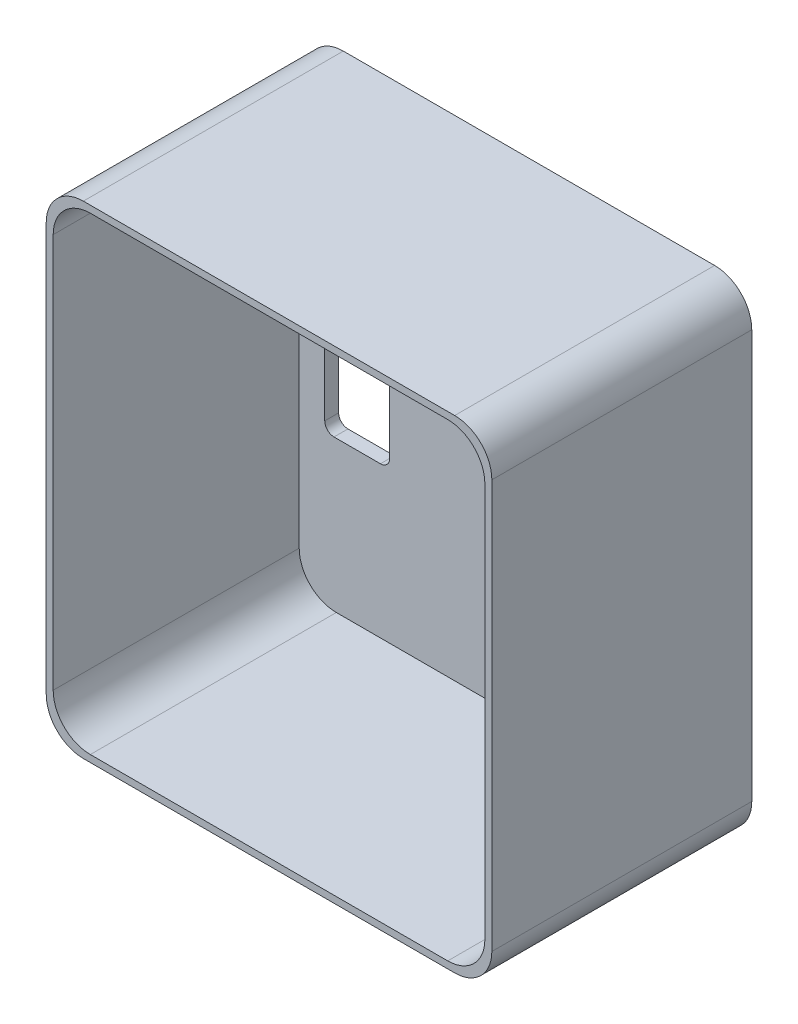
ISO-10303-21;
HEADER;
FILE_DESCRIPTION(('STEP AP214'),'2;1');
FILE_NAME('part.step','',(''),(''),'','','');
FILE_SCHEMA(('AUTOMOTIVE_DESIGN { 1 0 10303 214 1 1 1 1 }'));
ENDSEC;
DATA;
#1=APPLICATION_CONTEXT('core data for automotive mechanical design processes');
#2=APPLICATION_PROTOCOL_DEFINITION('international standard','automotive_design',2000,#1);
#3=PRODUCT_CONTEXT('',#1,'mechanical');
#4=PRODUCT('Part','Part','',(#3));
#5=PRODUCT_RELATED_PRODUCT_CATEGORY('part','',(#4));
#6=PRODUCT_DEFINITION_FORMATION('','',#4);
#7=PRODUCT_DEFINITION_CONTEXT('part definition',#1,'design');
#8=PRODUCT_DEFINITION('design','',#6,#7);
#9=PRODUCT_DEFINITION_SHAPE('','',#8);
#10=(LENGTH_UNIT() NAMED_UNIT(*) SI_UNIT(.MILLI.,.METRE.));
#11=(NAMED_UNIT(*) PLANE_ANGLE_UNIT() SI_UNIT($,.RADIAN.));
#12=(NAMED_UNIT(*) SI_UNIT($,.STERADIAN.) SOLID_ANGLE_UNIT());
#13=UNCERTAINTY_MEASURE_WITH_UNIT(LENGTH_MEASURE(1.E-05),#10,'distance_accuracy_value','');
#14=(GEOMETRIC_REPRESENTATION_CONTEXT(3) GLOBAL_UNCERTAINTY_ASSIGNED_CONTEXT((#13)) GLOBAL_UNIT_ASSIGNED_CONTEXT((#10,
#11,#12)) REPRESENTATION_CONTEXT('',''));
#15=CARTESIAN_POINT('',(0.,0.,0.));
#16=DIRECTION('',(0.,0.,1.));
#17=DIRECTION('',(1.,0.,0.));
#18=AXIS2_PLACEMENT_3D('',#15,#16,#17);
#19=CARTESIAN_POINT('',(20.,-22.,28.));
#20=DIRECTION('',(0.,0.,-1.));
#21=DIRECTION('',(-1.,0.,0.));
#22=AXIS2_PLACEMENT_3D('',#19,#20,#21);
#23=CYLINDRICAL_SURFACE('',#22,4.);
#24=CARTESIAN_POINT('',(20.,-22.,0.));
#25=DIRECTION('',(0.,0.,1.));
#26=DIRECTION('',(1.,0.,0.));
#27=AXIS2_PLACEMENT_3D('',#24,#25,#26);
#28=CIRCLE('',#27,4.);
#29=CARTESIAN_POINT('',(20.,-26.,0.));
#30=VERTEX_POINT('',#29);
#31=CARTESIAN_POINT('',(24.,-22.,0.));
#32=VERTEX_POINT('',#31);
#33=EDGE_CURVE('E361',#30,#32,#28,.T.);
#34=ORIENTED_EDGE('',*,*,#33,.T.);
#35=DIRECTION('',(0.,0.,-1.));
#36=VECTOR('',#35,1.);
#37=CARTESIAN_POINT('',(24.,-22.,28.));
#38=LINE('',#37,#36);
#39=CARTESIAN_POINT('',(24.,-22.,28.));
#40=VERTEX_POINT('',#39);
#41=EDGE_CURVE('E11',#40,#32,#38,.T.);
#42=ORIENTED_EDGE('',*,*,#41,.F.);
#43=CARTESIAN_POINT('',(20.,-22.,28.));
#44=DIRECTION('',(0.,0.,1.));
#45=DIRECTION('',(1.,0.,0.));
#46=AXIS2_PLACEMENT_3D('',#43,#44,#45);
#47=CIRCLE('',#46,4.);
#48=CARTESIAN_POINT('',(20.,-26.,28.));
#49=VERTEX_POINT('',#48);
#50=EDGE_CURVE('E383',#49,#40,#47,.T.);
#51=ORIENTED_EDGE('',*,*,#50,.F.);
#52=DIRECTION('',(0.,0.,-1.));
#53=VECTOR('',#52,1.);
#54=CARTESIAN_POINT('',(20.,-26.,28.));
#55=LINE('',#54,#53);
#56=EDGE_CURVE('E409',#49,#30,#55,.T.);
#57=ORIENTED_EDGE('',*,*,#56,.T.);
#58=EDGE_LOOP('',(#34,#42,#51,#57));
#59=FACE_BOUND('',#58,.T.);
#60=ADVANCED_FACE('F40',(#59),#23,.T.);
#61=CARTESIAN_POINT('',(24.,22.,28.));
#62=DIRECTION('',(-1.,0.,0.));
#63=DIRECTION('',(0.,-1.,0.));
#64=AXIS2_PLACEMENT_3D('',#61,#62,#63);
#65=PLANE('',#64);
#66=DIRECTION('',(0.,1.,0.));
#67=VECTOR('',#66,1.);
#68=CARTESIAN_POINT('',(24.,22.,0.));
#69=LINE('',#68,#67);
#70=CARTESIAN_POINT('',(24.,22.,0.));
#71=VERTEX_POINT('',#70);
#72=EDGE_CURVE('E413',#32,#71,#69,.T.);
#73=ORIENTED_EDGE('',*,*,#72,.T.);
#74=DIRECTION('',(0.,0.,-1.));
#75=VECTOR('',#74,1.);
#76=CARTESIAN_POINT('',(24.,22.,28.));
#77=LINE('',#76,#75);
#78=CARTESIAN_POINT('',(24.,22.,28.));
#79=VERTEX_POINT('',#78);
#80=EDGE_CURVE('E48',#79,#71,#77,.T.);
#81=ORIENTED_EDGE('',*,*,#80,.F.);
#82=DIRECTION('',(0.,1.,0.));
#83=VECTOR('',#82,1.);
#84=CARTESIAN_POINT('',(24.,22.,28.));
#85=LINE('',#84,#83);
#86=EDGE_CURVE('E387',#40,#79,#85,.T.);
#87=ORIENTED_EDGE('',*,*,#86,.F.);
#88=ORIENTED_EDGE('',*,*,#41,.T.);
#89=EDGE_LOOP('',(#73,#81,#87,#88));
#90=FACE_BOUND('',#89,.T.);
#91=ADVANCED_FACE('F483',(#90),#65,.F.);
#92=CARTESIAN_POINT('',(20.,22.,28.));
#93=DIRECTION('',(0.,0.,-1.));
#94=DIRECTION('',(-1.,0.,0.));
#95=AXIS2_PLACEMENT_3D('',#92,#93,#94);
#96=CYLINDRICAL_SURFACE('',#95,4.);
#97=CARTESIAN_POINT('',(20.,22.,0.));
#98=DIRECTION('',(0.,0.,1.));
#99=DIRECTION('',(1.,0.,0.));
#100=AXIS2_PLACEMENT_3D('',#97,#98,#99);
#101=CIRCLE('',#100,4.);
#102=CARTESIAN_POINT('',(20.,26.,0.));
#103=VERTEX_POINT('',#102);
#104=EDGE_CURVE('E416',#71,#103,#101,.T.);
#105=ORIENTED_EDGE('',*,*,#104,.T.);
#106=DIRECTION('',(0.,0.,-1.));
#107=VECTOR('',#106,1.);
#108=CARTESIAN_POINT('',(20.,26.,28.));
#109=LINE('',#108,#107);
#110=CARTESIAN_POINT('',(20.,26.,28.));
#111=VERTEX_POINT('',#110);
#112=EDGE_CURVE('E452',#111,#103,#109,.T.);
#113=ORIENTED_EDGE('',*,*,#112,.F.);
#114=CARTESIAN_POINT('',(20.,22.,28.));
#115=DIRECTION('',(0.,0.,1.));
#116=DIRECTION('',(1.,0.,0.));
#117=AXIS2_PLACEMENT_3D('',#114,#115,#116);
#118=CIRCLE('',#117,4.);
#119=EDGE_CURVE('E391',#79,#111,#118,.T.);
#120=ORIENTED_EDGE('',*,*,#119,.F.);
#121=ORIENTED_EDGE('',*,*,#80,.T.);
#122=EDGE_LOOP('',(#105,#113,#120,#121));
#123=FACE_BOUND('',#122,.T.);
#124=ADVANCED_FACE('F462',(#123),#96,.T.);
#125=CARTESIAN_POINT('',(-20.,26.,28.));
#126=DIRECTION('',(0.,-1.,0.));
#127=DIRECTION('',(0.,0.,-1.));
#128=AXIS2_PLACEMENT_3D('',#125,#126,#127);
#129=PLANE('',#128);
#130=DIRECTION('',(-1.,0.,0.));
#131=VECTOR('',#130,1.);
#132=CARTESIAN_POINT('',(-20.,26.,0.));
#133=LINE('',#132,#131);
#134=CARTESIAN_POINT('',(-20.,26.,0.));
#135=VERTEX_POINT('',#134);
#136=EDGE_CURVE('E419',#103,#135,#133,.T.);
#137=ORIENTED_EDGE('',*,*,#136,.T.);
#138=DIRECTION('',(0.,0.,-1.));
#139=VECTOR('',#138,1.);
#140=CARTESIAN_POINT('',(-20.,26.,28.));
#141=LINE('',#140,#139);
#142=CARTESIAN_POINT('',(-20.,26.,28.));
#143=VERTEX_POINT('',#142);
#144=EDGE_CURVE('E448',#143,#135,#141,.T.);
#145=ORIENTED_EDGE('',*,*,#144,.F.);
#146=DIRECTION('',(-1.,0.,0.));
#147=VECTOR('',#146,1.);
#148=CARTESIAN_POINT('',(-20.,26.,28.));
#149=LINE('',#148,#147);
#150=EDGE_CURVE('E394',#111,#143,#149,.T.);
#151=ORIENTED_EDGE('',*,*,#150,.F.);
#152=ORIENTED_EDGE('',*,*,#112,.T.);
#153=EDGE_LOOP('',(#137,#145,#151,#152));
#154=FACE_BOUND('',#153,.T.);
#155=ADVANCED_FACE('F471',(#154),#129,.F.);
#156=CARTESIAN_POINT('',(-20.,22.,28.));
#157=DIRECTION('',(0.,0.,-1.));
#158=DIRECTION('',(-1.,0.,0.));
#159=AXIS2_PLACEMENT_3D('',#156,#157,#158);
#160=CYLINDRICAL_SURFACE('',#159,4.);
#161=CARTESIAN_POINT('',(-20.,22.,0.));
#162=DIRECTION('',(0.,0.,1.));
#163=DIRECTION('',(1.,0.,0.));
#164=AXIS2_PLACEMENT_3D('',#161,#162,#163);
#165=CIRCLE('',#164,4.);
#166=CARTESIAN_POINT('',(-24.,22.,0.));
#167=VERTEX_POINT('',#166);
#168=EDGE_CURVE('E422',#135,#167,#165,.T.);
#169=ORIENTED_EDGE('',*,*,#168,.T.);
#170=DIRECTION('',(0.,0.,-1.));
#171=VECTOR('',#170,1.);
#172=CARTESIAN_POINT('',(-24.,22.,28.));
#173=LINE('',#172,#171);
#174=CARTESIAN_POINT('',(-24.,22.,28.));
#175=VERTEX_POINT('',#174);
#176=EDGE_CURVE('E444',#175,#167,#173,.T.);
#177=ORIENTED_EDGE('',*,*,#176,.F.);
#178=CARTESIAN_POINT('',(-20.,22.,28.));
#179=DIRECTION('',(0.,0.,1.));
#180=DIRECTION('',(1.,0.,0.));
#181=AXIS2_PLACEMENT_3D('',#178,#179,#180);
#182=CIRCLE('',#181,4.);
#183=EDGE_CURVE('E397',#143,#175,#182,.T.);
#184=ORIENTED_EDGE('',*,*,#183,.F.);
#185=ORIENTED_EDGE('',*,*,#144,.T.);
#186=EDGE_LOOP('',(#169,#177,#184,#185));
#187=FACE_BOUND('',#186,.T.);
#188=ADVANCED_FACE('F475',(#187),#160,.T.);
#189=CARTESIAN_POINT('',(-24.,22.,28.));
#190=DIRECTION('',(1.,0.,0.));
#191=DIRECTION('',(0.,1.,0.));
#192=AXIS2_PLACEMENT_3D('',#189,#190,#191);
#193=PLANE('',#192);
#194=DIRECTION('',(0.,-1.,0.));
#195=VECTOR('',#194,1.);
#196=CARTESIAN_POINT('',(-24.,22.,0.));
#197=LINE('',#196,#195);
#198=CARTESIAN_POINT('',(-24.,-22.,0.));
#199=VERTEX_POINT('',#198);
#200=EDGE_CURVE('E425',#167,#199,#197,.T.);
#201=ORIENTED_EDGE('',*,*,#200,.T.);
#202=DIRECTION('',(0.,0.,-1.));
#203=VECTOR('',#202,1.);
#204=CARTESIAN_POINT('',(-24.,-22.,28.));
#205=LINE('',#204,#203);
#206=CARTESIAN_POINT('',(-24.,-22.,28.));
#207=VERTEX_POINT('',#206);
#208=EDGE_CURVE('E440',#207,#199,#205,.T.);
#209=ORIENTED_EDGE('',*,*,#208,.F.);
#210=DIRECTION('',(0.,-1.,0.));
#211=VECTOR('',#210,1.);
#212=CARTESIAN_POINT('',(-24.,22.,28.));
#213=LINE('',#212,#211);
#214=EDGE_CURVE('E400',#175,#207,#213,.T.);
#215=ORIENTED_EDGE('',*,*,#214,.F.);
#216=ORIENTED_EDGE('',*,*,#176,.T.);
#217=EDGE_LOOP('',(#201,#209,#215,#216));
#218=FACE_BOUND('',#217,.T.);
#219=ADVANCED_FACE('F496',(#218),#193,.F.);
#220=CARTESIAN_POINT('',(-20.,-22.,28.));
#221=DIRECTION('',(0.,0.,-1.));
#222=DIRECTION('',(-1.,0.,0.));
#223=AXIS2_PLACEMENT_3D('',#220,#221,#222);
#224=CYLINDRICAL_SURFACE('',#223,4.);
#225=CARTESIAN_POINT('',(-20.,-22.,0.));
#226=DIRECTION('',(0.,0.,1.));
#227=DIRECTION('',(1.,0.,0.));
#228=AXIS2_PLACEMENT_3D('',#225,#226,#227);
#229=CIRCLE('',#228,4.);
#230=CARTESIAN_POINT('',(-20.,-26.,0.));
#231=VERTEX_POINT('',#230);
#232=EDGE_CURVE('E428',#199,#231,#229,.T.);
#233=ORIENTED_EDGE('',*,*,#232,.T.);
#234=DIRECTION('',(0.,0.,-1.));
#235=VECTOR('',#234,1.);
#236=CARTESIAN_POINT('',(-20.,-26.,28.));
#237=LINE('',#236,#235);
#238=CARTESIAN_POINT('',(-20.,-26.,28.));
#239=VERTEX_POINT('',#238);
#240=EDGE_CURVE('E436',#239,#231,#237,.T.);
#241=ORIENTED_EDGE('',*,*,#240,.F.);
#242=CARTESIAN_POINT('',(-20.,-22.,28.));
#243=DIRECTION('',(0.,0.,1.));
#244=DIRECTION('',(1.,0.,0.));
#245=AXIS2_PLACEMENT_3D('',#242,#243,#244);
#246=CIRCLE('',#245,4.);
#247=EDGE_CURVE('E403',#207,#239,#246,.T.);
#248=ORIENTED_EDGE('',*,*,#247,.F.);
#249=ORIENTED_EDGE('',*,*,#208,.T.);
#250=EDGE_LOOP('',(#233,#241,#248,#249));
#251=FACE_BOUND('',#250,.T.);
#252=ADVANCED_FACE('F494',(#251),#224,.T.);
#253=CARTESIAN_POINT('',(-20.,-26.,28.));
#254=DIRECTION('',(0.,1.,0.));
#255=DIRECTION('',(0.,0.,1.));
#256=AXIS2_PLACEMENT_3D('',#253,#254,#255);
#257=PLANE('',#256);
#258=DIRECTION('',(1.,0.,0.));
#259=VECTOR('',#258,1.);
#260=CARTESIAN_POINT('',(-20.,-26.,0.));
#261=LINE('',#260,#259);
#262=EDGE_CURVE('E388',#231,#30,#261,.T.);
#263=ORIENTED_EDGE('',*,*,#262,.T.);
#264=ORIENTED_EDGE('',*,*,#56,.F.);
#265=DIRECTION('',(1.,0.,0.));
#266=VECTOR('',#265,1.);
#267=CARTESIAN_POINT('',(-20.,-26.,28.));
#268=LINE('',#267,#266);
#269=EDGE_CURVE('E406',#239,#49,#268,.T.);
#270=ORIENTED_EDGE('',*,*,#269,.F.);
#271=ORIENTED_EDGE('',*,*,#240,.T.);
#272=EDGE_LOOP('',(#263,#264,#270,#271));
#273=FACE_BOUND('',#272,.T.);
#274=ADVANCED_FACE('F489',(#273),#257,.F.);
#275=CARTESIAN_POINT('',(20.,-22.,28.));
#276=DIRECTION('',(0.,0.,1.));
#277=DIRECTION('',(1.,0.,0.));
#278=AXIS2_PLACEMENT_3D('',#275,#276,#277);
#279=PLANE('',#278);
#280=CARTESIAN_POINT('',(-19.25,-21.25,28.));
#281=DIRECTION('',(0.,0.,1.));
#282=DIRECTION('',(1.,0.,0.));
#283=AXIS2_PLACEMENT_3D('',#280,#281,#282);
#284=CIRCLE('',#283,4.);
#285=CARTESIAN_POINT('',(-23.25,-21.25,28.));
#286=VERTEX_POINT('',#285);
#287=CARTESIAN_POINT('',(-19.25,-25.25,28.));
#288=VERTEX_POINT('',#287);
#289=EDGE_CURVE('E277',#286,#288,#284,.T.);
#290=ORIENTED_EDGE('',*,*,#289,.F.);
#291=DIRECTION('',(0.,-1.,0.));
#292=VECTOR('',#291,1.);
#293=CARTESIAN_POINT('',(-23.25,21.25,28.));
#294=LINE('',#293,#292);
#295=CARTESIAN_POINT('',(-23.25,21.25,28.));
#296=VERTEX_POINT('',#295);
#297=EDGE_CURVE('E300',#296,#286,#294,.T.);
#298=ORIENTED_EDGE('',*,*,#297,.F.);
#299=CARTESIAN_POINT('',(-19.25,21.25,28.));
#300=DIRECTION('',(0.,0.,1.));
#301=DIRECTION('',(1.,0.,0.));
#302=AXIS2_PLACEMENT_3D('',#299,#300,#301);
#303=CIRCLE('',#302,4.);
#304=CARTESIAN_POINT('',(-19.25,25.25,28.));
#305=VERTEX_POINT('',#304);
#306=EDGE_CURVE('E351',#305,#296,#303,.T.);
#307=ORIENTED_EDGE('',*,*,#306,.F.);
#308=DIRECTION('',(-1.,0.,0.));
#309=VECTOR('',#308,1.);
#310=CARTESIAN_POINT('',(-19.25,25.25,28.));
#311=LINE('',#310,#309);
#312=CARTESIAN_POINT('',(19.25,25.25,28.));
#313=VERTEX_POINT('',#312);
#314=EDGE_CURVE('E347',#313,#305,#311,.T.);
#315=ORIENTED_EDGE('',*,*,#314,.F.);
#316=CARTESIAN_POINT('',(19.25,21.25,28.));
#317=DIRECTION('',(0.,0.,1.));
#318=DIRECTION('',(1.,0.,0.));
#319=AXIS2_PLACEMENT_3D('',#316,#317,#318);
#320=CIRCLE('',#319,4.);
#321=CARTESIAN_POINT('',(23.25,21.25,28.));
#322=VERTEX_POINT('',#321);
#323=EDGE_CURVE('E343',#322,#313,#320,.T.);
#324=ORIENTED_EDGE('',*,*,#323,.F.);
#325=DIRECTION('',(0.,1.,0.));
#326=VECTOR('',#325,1.);
#327=CARTESIAN_POINT('',(23.25,21.25,28.));
#328=LINE('',#327,#326);
#329=CARTESIAN_POINT('',(23.25,-21.25,28.));
#330=VERTEX_POINT('',#329);
#331=EDGE_CURVE('E339',#330,#322,#328,.T.);
#332=ORIENTED_EDGE('',*,*,#331,.F.);
#333=CARTESIAN_POINT('',(19.25,-21.25,28.));
#334=DIRECTION('',(0.,0.,1.));
#335=DIRECTION('',(1.,0.,0.));
#336=AXIS2_PLACEMENT_3D('',#333,#334,#335);
#337=CIRCLE('',#336,4.);
#338=CARTESIAN_POINT('',(19.25,-25.25,28.));
#339=VERTEX_POINT('',#338);
#340=EDGE_CURVE('E335',#339,#330,#337,.T.);
#341=ORIENTED_EDGE('',*,*,#340,.F.);
#342=DIRECTION('',(1.,0.,0.));
#343=VECTOR('',#342,1.);
#344=CARTESIAN_POINT('',(-19.25,-25.25,28.));
#345=LINE('',#344,#343);
#346=EDGE_CURVE('E331',#288,#339,#345,.T.);
#347=ORIENTED_EDGE('',*,*,#346,.F.);
#348=EDGE_LOOP('',(#290,#298,#307,#315,#324,#332,#341,#347));
#349=FACE_BOUND('',#348,.T.);
#350=ORIENTED_EDGE('',*,*,#50,.T.);
#351=ORIENTED_EDGE('',*,*,#86,.T.);
#352=ORIENTED_EDGE('',*,*,#119,.T.);
#353=ORIENTED_EDGE('',*,*,#150,.T.);
#354=ORIENTED_EDGE('',*,*,#183,.T.);
#355=ORIENTED_EDGE('',*,*,#214,.T.);
#356=ORIENTED_EDGE('',*,*,#247,.T.);
#357=ORIENTED_EDGE('',*,*,#269,.T.);
#358=EDGE_LOOP('',(#350,#351,#352,#353,#354,#355,#356,#357));
#359=FACE_BOUND('',#358,.T.);
#360=ADVANCED_FACE('F479',(#349,#359),#279,.T.);
#361=CARTESIAN_POINT('',(20.,-22.,0.));
#362=DIRECTION('',(0.,0.,1.));
#363=DIRECTION('',(1.,0.,0.));
#364=AXIS2_PLACEMENT_3D('',#361,#362,#363);
#365=PLANE('',#364);
#366=DIRECTION('',(0.,-1.,0.));
#367=VECTOR('',#366,1.);
#368=CARTESIAN_POINT('',(-20.5,8.,0.));
#369=LINE('',#368,#367);
#370=CARTESIAN_POINT('',(-20.5,8.,0.));
#371=VERTEX_POINT('',#370);
#372=CARTESIAN_POINT('',(-20.5,-8.,0.));
#373=VERTEX_POINT('',#372);
#374=EDGE_CURVE('E210',#371,#373,#369,.T.);
#375=ORIENTED_EDGE('',*,*,#374,.T.);
#376=CARTESIAN_POINT('',(-19.5,-8.,0.));
#377=DIRECTION('',(0.,0.,1.));
#378=DIRECTION('',(1.,0.,0.));
#379=AXIS2_PLACEMENT_3D('',#376,#377,#378);
#380=CIRCLE('',#379,1.);
#381=CARTESIAN_POINT('',(-19.5,-9.,0.));
#382=VERTEX_POINT('',#381);
#383=EDGE_CURVE('E203',#373,#382,#380,.T.);
#384=ORIENTED_EDGE('',*,*,#383,.T.);
#385=DIRECTION('',(1.,0.,0.));
#386=VECTOR('',#385,1.);
#387=CARTESIAN_POINT('',(-19.5,-9.,0.));
#388=LINE('',#387,#386);
#389=CARTESIAN_POINT('',(-14.5,-9.,0.));
#390=VERTEX_POINT('',#389);
#391=EDGE_CURVE('E213',#382,#390,#388,.T.);
#392=ORIENTED_EDGE('',*,*,#391,.T.);
#393=CARTESIAN_POINT('',(-14.5,-8.,0.));
#394=DIRECTION('',(0.,0.,1.));
#395=DIRECTION('',(1.,0.,0.));
#396=AXIS2_PLACEMENT_3D('',#393,#394,#395);
#397=CIRCLE('',#396,1.);
#398=CARTESIAN_POINT('',(-13.5,-8.,0.));
#399=VERTEX_POINT('',#398);
#400=EDGE_CURVE('E55',#390,#399,#397,.T.);
#401=ORIENTED_EDGE('',*,*,#400,.T.);
#402=DIRECTION('',(0.,1.,0.));
#403=VECTOR('',#402,1.);
#404=CARTESIAN_POINT('',(-13.5,8.,0.));
#405=LINE('',#404,#403);
#406=CARTESIAN_POINT('',(-13.5,8.,0.));
#407=VERTEX_POINT('',#406);
#408=EDGE_CURVE('E233',#399,#407,#405,.T.);
#409=ORIENTED_EDGE('',*,*,#408,.T.);
#410=CARTESIAN_POINT('',(-14.5,8.,0.));
#411=DIRECTION('',(0.,0.,1.));
#412=DIRECTION('',(1.,0.,0.));
#413=AXIS2_PLACEMENT_3D('',#410,#411,#412);
#414=CIRCLE('',#413,1.);
#415=CARTESIAN_POINT('',(-14.5,9.,0.));
#416=VERTEX_POINT('',#415);
#417=EDGE_CURVE('E237',#407,#416,#414,.T.);
#418=ORIENTED_EDGE('',*,*,#417,.T.);
#419=DIRECTION('',(-1.,0.,0.));
#420=VECTOR('',#419,1.);
#421=CARTESIAN_POINT('',(-19.5,9.,0.));
#422=LINE('',#421,#420);
#423=CARTESIAN_POINT('',(-19.5,9.,0.));
#424=VERTEX_POINT('',#423);
#425=EDGE_CURVE('E241',#416,#424,#422,.T.);
#426=ORIENTED_EDGE('',*,*,#425,.T.);
#427=CARTESIAN_POINT('',(-19.5,8.,0.));
#428=DIRECTION('',(0.,0.,1.));
#429=DIRECTION('',(1.,0.,0.));
#430=AXIS2_PLACEMENT_3D('',#427,#428,#429);
#431=CIRCLE('',#430,1.);
#432=EDGE_CURVE('E245',#424,#371,#431,.T.);
#433=ORIENTED_EDGE('',*,*,#432,.T.);
#434=EDGE_LOOP('',(#375,#384,#392,#401,#409,#418,#426,#433));
#435=FACE_BOUND('',#434,.T.);
#436=ORIENTED_EDGE('',*,*,#33,.F.);
#437=ORIENTED_EDGE('',*,*,#262,.F.);
#438=ORIENTED_EDGE('',*,*,#232,.F.);
#439=ORIENTED_EDGE('',*,*,#200,.F.);
#440=ORIENTED_EDGE('',*,*,#168,.F.);
#441=ORIENTED_EDGE('',*,*,#136,.F.);
#442=ORIENTED_EDGE('',*,*,#104,.F.);
#443=ORIENTED_EDGE('',*,*,#72,.F.);
#444=EDGE_LOOP('',(#436,#437,#438,#439,#440,#441,#442,#443));
#445=FACE_BOUND('',#444,.T.);
#446=ADVANCED_FACE('F218',(#435,#445),#365,.F.);
#447=CARTESIAN_POINT('',(-19.25,-21.25,1.5));
#448=DIRECTION('',(0.,0.,1.));
#449=DIRECTION('',(1.,0.,0.));
#450=AXIS2_PLACEMENT_3D('',#447,#448,#449);
#451=CYLINDRICAL_SURFACE('',#450,4.);
#452=ORIENTED_EDGE('',*,*,#289,.T.);
#453=DIRECTION('',(0.,0.,1.));
#454=VECTOR('',#453,1.);
#455=CARTESIAN_POINT('',(-19.25,-25.25,1.5));
#456=LINE('',#455,#454);
#457=CARTESIAN_POINT('',(-19.25,-25.25,1.5));
#458=VERTEX_POINT('',#457);
#459=EDGE_CURVE('E328',#458,#288,#456,.T.);
#460=ORIENTED_EDGE('',*,*,#459,.F.);
#461=CARTESIAN_POINT('',(-19.25,-21.25,1.5));
#462=DIRECTION('',(0.,0.,1.));
#463=DIRECTION('',(1.,0.,0.));
#464=AXIS2_PLACEMENT_3D('',#461,#462,#463);
#465=CIRCLE('',#464,4.);
#466=CARTESIAN_POINT('',(-23.25,-21.25,1.5));
#467=VERTEX_POINT('',#466);
#468=EDGE_CURVE('E295',#467,#458,#465,.T.);
#469=ORIENTED_EDGE('',*,*,#468,.F.);
#470=DIRECTION('',(0.,0.,1.));
#471=VECTOR('',#470,1.);
#472=CARTESIAN_POINT('',(-23.25,-21.25,1.5));
#473=LINE('',#472,#471);
#474=EDGE_CURVE('E358',#467,#286,#473,.T.);
#475=ORIENTED_EDGE('',*,*,#474,.T.);
#476=EDGE_LOOP('',(#452,#460,#469,#475));
#477=FACE_BOUND('',#476,.T.);
#478=ADVANCED_FACE('F560',(#477),#451,.F.);
#479=CARTESIAN_POINT('',(-23.25,21.25,1.5));
#480=DIRECTION('',(-1.,0.,0.));
#481=DIRECTION('',(0.,-1.,0.));
#482=AXIS2_PLACEMENT_3D('',#479,#480,#481);
#483=PLANE('',#482);
#484=ORIENTED_EDGE('',*,*,#297,.T.);
#485=ORIENTED_EDGE('',*,*,#474,.F.);
#486=DIRECTION('',(0.,-1.,0.));
#487=VECTOR('',#486,1.);
#488=CARTESIAN_POINT('',(-23.25,21.25,1.5));
#489=LINE('',#488,#487);
#490=CARTESIAN_POINT('',(-23.25,21.25,1.5));
#491=VERTEX_POINT('',#490);
#492=EDGE_CURVE('E324',#491,#467,#489,.T.);
#493=ORIENTED_EDGE('',*,*,#492,.F.);
#494=DIRECTION('',(0.,0.,1.));
#495=VECTOR('',#494,1.);
#496=CARTESIAN_POINT('',(-23.25,21.25,1.5));
#497=LINE('',#496,#495);
#498=EDGE_CURVE('E362',#491,#296,#497,.T.);
#499=ORIENTED_EDGE('',*,*,#498,.T.);
#500=EDGE_LOOP('',(#484,#485,#493,#499));
#501=FACE_BOUND('',#500,.T.);
#502=ADVANCED_FACE('F570',(#501),#483,.F.);
#503=CARTESIAN_POINT('',(-19.25,21.25,1.5));
#504=DIRECTION('',(0.,0.,1.));
#505=DIRECTION('',(1.,0.,0.));
#506=AXIS2_PLACEMENT_3D('',#503,#504,#505);
#507=CYLINDRICAL_SURFACE('',#506,4.);
#508=ORIENTED_EDGE('',*,*,#306,.T.);
#509=ORIENTED_EDGE('',*,*,#498,.F.);
#510=CARTESIAN_POINT('',(-19.25,21.25,1.5));
#511=DIRECTION('',(0.,0.,1.));
#512=DIRECTION('',(1.,0.,0.));
#513=AXIS2_PLACEMENT_3D('',#510,#511,#512);
#514=CIRCLE('',#513,4.);
#515=CARTESIAN_POINT('',(-19.25,25.25,1.5));
#516=VERTEX_POINT('',#515);
#517=EDGE_CURVE('E320',#516,#491,#514,.T.);
#518=ORIENTED_EDGE('',*,*,#517,.F.);
#519=DIRECTION('',(0.,0.,1.));
#520=VECTOR('',#519,1.);
#521=CARTESIAN_POINT('',(-19.25,25.25,1.5));
#522=LINE('',#521,#520);
#523=EDGE_CURVE('E365',#516,#305,#522,.T.);
#524=ORIENTED_EDGE('',*,*,#523,.T.);
#525=EDGE_LOOP('',(#508,#509,#518,#524));
#526=FACE_BOUND('',#525,.T.);
#527=ADVANCED_FACE('F580',(#526),#507,.F.);
#528=CARTESIAN_POINT('',(-19.25,25.25,1.5));
#529=DIRECTION('',(0.,1.,0.));
#530=DIRECTION('',(0.,0.,1.));
#531=AXIS2_PLACEMENT_3D('',#528,#529,#530);
#532=PLANE('',#531);
#533=ORIENTED_EDGE('',*,*,#314,.T.);
#534=ORIENTED_EDGE('',*,*,#523,.F.);
#535=DIRECTION('',(-1.,0.,0.));
#536=VECTOR('',#535,1.);
#537=CARTESIAN_POINT('',(-19.25,25.25,1.5));
#538=LINE('',#537,#536);
#539=CARTESIAN_POINT('',(19.25,25.25,1.5));
#540=VERTEX_POINT('',#539);
#541=EDGE_CURVE('E316',#540,#516,#538,.T.);
#542=ORIENTED_EDGE('',*,*,#541,.F.);
#543=DIRECTION('',(0.,0.,1.));
#544=VECTOR('',#543,1.);
#545=CARTESIAN_POINT('',(19.25,25.25,1.5));
#546=LINE('',#545,#544);
#547=EDGE_CURVE('E368',#540,#313,#546,.T.);
#548=ORIENTED_EDGE('',*,*,#547,.T.);
#549=EDGE_LOOP('',(#533,#534,#542,#548));
#550=FACE_BOUND('',#549,.T.);
#551=ADVANCED_FACE('F590',(#550),#532,.F.);
#552=CARTESIAN_POINT('',(19.25,21.25,1.5));
#553=DIRECTION('',(0.,0.,1.));
#554=DIRECTION('',(1.,0.,0.));
#555=AXIS2_PLACEMENT_3D('',#552,#553,#554);
#556=CYLINDRICAL_SURFACE('',#555,4.);
#557=ORIENTED_EDGE('',*,*,#323,.T.);
#558=ORIENTED_EDGE('',*,*,#547,.F.);
#559=CARTESIAN_POINT('',(19.25,21.25,1.5));
#560=DIRECTION('',(0.,0.,1.));
#561=DIRECTION('',(1.,0.,0.));
#562=AXIS2_PLACEMENT_3D('',#559,#560,#561);
#563=CIRCLE('',#562,4.);
#564=CARTESIAN_POINT('',(23.25,21.25,1.5));
#565=VERTEX_POINT('',#564);
#566=EDGE_CURVE('E312',#565,#540,#563,.T.);
#567=ORIENTED_EDGE('',*,*,#566,.F.);
#568=DIRECTION('',(0.,0.,1.));
#569=VECTOR('',#568,1.);
#570=CARTESIAN_POINT('',(23.25,21.25,1.5));
#571=LINE('',#570,#569);
#572=EDGE_CURVE('E371',#565,#322,#571,.T.);
#573=ORIENTED_EDGE('',*,*,#572,.T.);
#574=EDGE_LOOP('',(#557,#558,#567,#573));
#575=FACE_BOUND('',#574,.T.);
#576=ADVANCED_FACE('F600',(#575),#556,.F.);
#577=CARTESIAN_POINT('',(23.25,21.25,1.5));
#578=DIRECTION('',(1.,0.,0.));
#579=DIRECTION('',(0.,1.,0.));
#580=AXIS2_PLACEMENT_3D('',#577,#578,#579);
#581=PLANE('',#580);
#582=ORIENTED_EDGE('',*,*,#331,.T.);
#583=ORIENTED_EDGE('',*,*,#572,.F.);
#584=DIRECTION('',(0.,1.,0.));
#585=VECTOR('',#584,1.);
#586=CARTESIAN_POINT('',(23.25,21.25,1.5));
#587=LINE('',#586,#585);
#588=CARTESIAN_POINT('',(23.25,-21.25,1.5));
#589=VERTEX_POINT('',#588);
#590=EDGE_CURVE('E308',#589,#565,#587,.T.);
#591=ORIENTED_EDGE('',*,*,#590,.F.);
#592=DIRECTION('',(0.,0.,1.));
#593=VECTOR('',#592,1.);
#594=CARTESIAN_POINT('',(23.25,-21.25,1.5));
#595=LINE('',#594,#593);
#596=EDGE_CURVE('E374',#589,#330,#595,.T.);
#597=ORIENTED_EDGE('',*,*,#596,.T.);
#598=EDGE_LOOP('',(#582,#583,#591,#597));
#599=FACE_BOUND('',#598,.T.);
#600=ADVANCED_FACE('F610',(#599),#581,.F.);
#601=CARTESIAN_POINT('',(19.25,-21.25,1.5));
#602=DIRECTION('',(0.,0.,1.));
#603=DIRECTION('',(1.,0.,0.));
#604=AXIS2_PLACEMENT_3D('',#601,#602,#603);
#605=CYLINDRICAL_SURFACE('',#604,4.);
#606=ORIENTED_EDGE('',*,*,#340,.T.);
#607=ORIENTED_EDGE('',*,*,#596,.F.);
#608=CARTESIAN_POINT('',(19.25,-21.25,1.5));
#609=DIRECTION('',(0.,0.,1.));
#610=DIRECTION('',(1.,0.,0.));
#611=AXIS2_PLACEMENT_3D('',#608,#609,#610);
#612=CIRCLE('',#611,4.);
#613=CARTESIAN_POINT('',(19.25,-25.25,1.5));
#614=VERTEX_POINT('',#613);
#615=EDGE_CURVE('E304',#614,#589,#612,.T.);
#616=ORIENTED_EDGE('',*,*,#615,.F.);
#617=DIRECTION('',(0.,0.,1.));
#618=VECTOR('',#617,1.);
#619=CARTESIAN_POINT('',(19.25,-25.25,1.5));
#620=LINE('',#619,#618);
#621=EDGE_CURVE('E377',#614,#339,#620,.T.);
#622=ORIENTED_EDGE('',*,*,#621,.T.);
#623=EDGE_LOOP('',(#606,#607,#616,#622));
#624=FACE_BOUND('',#623,.T.);
#625=ADVANCED_FACE('F620',(#624),#605,.F.);
#626=CARTESIAN_POINT('',(-19.25,-25.25,1.5));
#627=DIRECTION('',(0.,-1.,0.));
#628=DIRECTION('',(0.,0.,-1.));
#629=AXIS2_PLACEMENT_3D('',#626,#627,#628);
#630=PLANE('',#629);
#631=ORIENTED_EDGE('',*,*,#346,.T.);
#632=ORIENTED_EDGE('',*,*,#621,.F.);
#633=DIRECTION('',(1.,0.,0.));
#634=VECTOR('',#633,1.);
#635=CARTESIAN_POINT('',(-19.25,-25.25,1.5));
#636=LINE('',#635,#634);
#637=EDGE_CURVE('E299',#458,#614,#636,.T.);
#638=ORIENTED_EDGE('',*,*,#637,.F.);
#639=ORIENTED_EDGE('',*,*,#459,.T.);
#640=EDGE_LOOP('',(#631,#632,#638,#639));
#641=FACE_BOUND('',#640,.T.);
#642=ADVANCED_FACE('F630',(#641),#630,.F.);
#643=CARTESIAN_POINT('',(-19.25,-21.25,1.5));
#644=DIRECTION('',(0.,0.,1.));
#645=DIRECTION('',(1.,0.,0.));
#646=AXIS2_PLACEMENT_3D('',#643,#644,#645);
#647=PLANE('',#646);
#648=CARTESIAN_POINT('',(-19.5,-8.,1.5));
#649=DIRECTION('',(0.,0.,1.));
#650=DIRECTION('',(1.,0.,0.));
#651=AXIS2_PLACEMENT_3D('',#648,#649,#650);
#652=CIRCLE('',#651,1.);
#653=CARTESIAN_POINT('',(-20.5,-8.,1.5));
#654=VERTEX_POINT('',#653);
#655=CARTESIAN_POINT('',(-19.5,-9.,1.5));
#656=VERTEX_POINT('',#655);
#657=EDGE_CURVE('E63',#654,#656,#652,.T.);
#658=ORIENTED_EDGE('',*,*,#657,.F.);
#659=DIRECTION('',(0.,-1.,0.));
#660=VECTOR('',#659,1.);
#661=CARTESIAN_POINT('',(-20.5,8.,1.5));
#662=LINE('',#661,#660);
#663=CARTESIAN_POINT('',(-20.5,8.,1.5));
#664=VERTEX_POINT('',#663);
#665=EDGE_CURVE('E223',#664,#654,#662,.T.);
#666=ORIENTED_EDGE('',*,*,#665,.F.);
#667=CARTESIAN_POINT('',(-19.5,8.,1.5));
#668=DIRECTION('',(0.,0.,1.));
#669=DIRECTION('',(1.,0.,0.));
#670=AXIS2_PLACEMENT_3D('',#667,#668,#669);
#671=CIRCLE('',#670,1.);
#672=CARTESIAN_POINT('',(-19.5,9.,1.5));
#673=VERTEX_POINT('',#672);
#674=EDGE_CURVE('E228',#673,#664,#671,.T.);
#675=ORIENTED_EDGE('',*,*,#674,.F.);
#676=DIRECTION('',(-1.,0.,0.));
#677=VECTOR('',#676,1.);
#678=CARTESIAN_POINT('',(-19.5,9.,1.5));
#679=LINE('',#678,#677);
#680=CARTESIAN_POINT('',(-14.5,9.,1.5));
#681=VERTEX_POINT('',#680);
#682=EDGE_CURVE('E267',#681,#673,#679,.T.);
#683=ORIENTED_EDGE('',*,*,#682,.F.);
#684=CARTESIAN_POINT('',(-14.5,8.,1.5));
#685=DIRECTION('',(0.,0.,1.));
#686=DIRECTION('',(1.,0.,0.));
#687=AXIS2_PLACEMENT_3D('',#684,#685,#686);
#688=CIRCLE('',#687,1.);
#689=CARTESIAN_POINT('',(-13.5,8.,1.5));
#690=VERTEX_POINT('',#689);
#691=EDGE_CURVE('E263',#690,#681,#688,.T.);
#692=ORIENTED_EDGE('',*,*,#691,.F.);
#693=DIRECTION('',(0.,1.,0.));
#694=VECTOR('',#693,1.);
#695=CARTESIAN_POINT('',(-13.5,8.,1.5));
#696=LINE('',#695,#694);
#697=CARTESIAN_POINT('',(-13.5,-8.,1.5));
#698=VERTEX_POINT('',#697);
#699=EDGE_CURVE('E259',#698,#690,#696,.T.);
#700=ORIENTED_EDGE('',*,*,#699,.F.);
#701=CARTESIAN_POINT('',(-14.5,-8.,1.5));
#702=DIRECTION('',(0.,0.,1.));
#703=DIRECTION('',(1.,0.,0.));
#704=AXIS2_PLACEMENT_3D('',#701,#702,#703);
#705=CIRCLE('',#704,1.);
#706=CARTESIAN_POINT('',(-14.5,-9.,1.5));
#707=VERTEX_POINT('',#706);
#708=EDGE_CURVE('E255',#707,#698,#705,.T.);
#709=ORIENTED_EDGE('',*,*,#708,.F.);
#710=DIRECTION('',(1.,0.,0.));
#711=VECTOR('',#710,1.);
#712=CARTESIAN_POINT('',(-19.5,-9.,1.5));
#713=LINE('',#712,#711);
#714=EDGE_CURVE('E252',#656,#707,#713,.T.);
#715=ORIENTED_EDGE('',*,*,#714,.F.);
#716=EDGE_LOOP('',(#658,#666,#675,#683,#692,#700,#709,#715));
#717=FACE_BOUND('',#716,.T.);
#718=ORIENTED_EDGE('',*,*,#468,.T.);
#719=ORIENTED_EDGE('',*,*,#637,.T.);
#720=ORIENTED_EDGE('',*,*,#615,.T.);
#721=ORIENTED_EDGE('',*,*,#590,.T.);
#722=ORIENTED_EDGE('',*,*,#566,.T.);
#723=ORIENTED_EDGE('',*,*,#541,.T.);
#724=ORIENTED_EDGE('',*,*,#517,.T.);
#725=ORIENTED_EDGE('',*,*,#492,.T.);
#726=EDGE_LOOP('',(#718,#719,#720,#721,#722,#723,#724,#725));
#727=FACE_BOUND('',#726,.T.);
#728=ADVANCED_FACE('F639',(#717,#727),#647,.T.);
#729=CARTESIAN_POINT('',(-19.5,-8.,0.));
#730=DIRECTION('',(0.,0.,1.));
#731=DIRECTION('',(1.,0.,0.));
#732=AXIS2_PLACEMENT_3D('',#729,#730,#731);
#733=CYLINDRICAL_SURFACE('',#732,1.);
#734=ORIENTED_EDGE('',*,*,#657,.T.);
#735=DIRECTION('',(0.,0.,1.));
#736=VECTOR('',#735,1.);
#737=CARTESIAN_POINT('',(-19.5,-9.,0.));
#738=LINE('',#737,#736);
#739=EDGE_CURVE('E199',#382,#656,#738,.T.);
#740=ORIENTED_EDGE('',*,*,#739,.F.);
#741=ORIENTED_EDGE('',*,*,#383,.F.);
#742=DIRECTION('',(0.,0.,1.));
#743=VECTOR('',#742,1.);
#744=CARTESIAN_POINT('',(-20.5,-8.,0.));
#745=LINE('',#744,#743);
#746=EDGE_CURVE('E274',#373,#654,#745,.T.);
#747=ORIENTED_EDGE('',*,*,#746,.T.);
#748=EDGE_LOOP('',(#734,#740,#741,#747));
#749=FACE_BOUND('',#748,.T.);
#750=ADVANCED_FACE('F201',(#749),#733,.F.);
#751=CARTESIAN_POINT('',(-20.5,8.,0.));
#752=DIRECTION('',(-1.,0.,0.));
#753=DIRECTION('',(0.,-1.,0.));
#754=AXIS2_PLACEMENT_3D('',#751,#752,#753);
#755=PLANE('',#754);
#756=ORIENTED_EDGE('',*,*,#665,.T.);
#757=ORIENTED_EDGE('',*,*,#746,.F.);
#758=ORIENTED_EDGE('',*,*,#374,.F.);
#759=DIRECTION('',(0.,0.,1.));
#760=VECTOR('',#759,1.);
#761=CARTESIAN_POINT('',(-20.5,8.,0.));
#762=LINE('',#761,#760);
#763=EDGE_CURVE('E278',#371,#664,#762,.T.);
#764=ORIENTED_EDGE('',*,*,#763,.T.);
#765=EDGE_LOOP('',(#756,#757,#758,#764));
#766=FACE_BOUND('',#765,.T.);
#767=ADVANCED_FACE('F657',(#766),#755,.F.);
#768=CARTESIAN_POINT('',(-19.5,8.,0.));
#769=DIRECTION('',(0.,0.,1.));
#770=DIRECTION('',(1.,0.,0.));
#771=AXIS2_PLACEMENT_3D('',#768,#769,#770);
#772=CYLINDRICAL_SURFACE('',#771,1.);
#773=ORIENTED_EDGE('',*,*,#674,.T.);
#774=ORIENTED_EDGE('',*,*,#763,.F.);
#775=ORIENTED_EDGE('',*,*,#432,.F.);
#776=DIRECTION('',(0.,0.,1.));
#777=VECTOR('',#776,1.);
#778=CARTESIAN_POINT('',(-19.5,9.,0.));
#779=LINE('',#778,#777);
#780=EDGE_CURVE('E281',#424,#673,#779,.T.);
#781=ORIENTED_EDGE('',*,*,#780,.T.);
#782=EDGE_LOOP('',(#773,#774,#775,#781));
#783=FACE_BOUND('',#782,.T.);
#784=ADVANCED_FACE('F666',(#783),#772,.F.);
#785=CARTESIAN_POINT('',(-19.5,9.,0.));
#786=DIRECTION('',(0.,1.,0.));
#787=DIRECTION('',(-1.,0.,0.));
#788=AXIS2_PLACEMENT_3D('',#785,#786,#787);
#789=PLANE('',#788);
#790=ORIENTED_EDGE('',*,*,#682,.T.);
#791=ORIENTED_EDGE('',*,*,#780,.F.);
#792=ORIENTED_EDGE('',*,*,#425,.F.);
#793=DIRECTION('',(0.,0.,1.));
#794=VECTOR('',#793,1.);
#795=CARTESIAN_POINT('',(-14.5,9.,0.));
#796=LINE('',#795,#794);
#797=EDGE_CURVE('E284',#416,#681,#796,.T.);
#798=ORIENTED_EDGE('',*,*,#797,.T.);
#799=EDGE_LOOP('',(#790,#791,#792,#798));
#800=FACE_BOUND('',#799,.T.);
#801=ADVANCED_FACE('F676',(#800),#789,.F.);
#802=CARTESIAN_POINT('',(-14.5,8.,0.));
#803=DIRECTION('',(0.,0.,1.));
#804=DIRECTION('',(1.,0.,0.));
#805=AXIS2_PLACEMENT_3D('',#802,#803,#804);
#806=CYLINDRICAL_SURFACE('',#805,1.);
#807=ORIENTED_EDGE('',*,*,#691,.T.);
#808=ORIENTED_EDGE('',*,*,#797,.F.);
#809=ORIENTED_EDGE('',*,*,#417,.F.);
#810=DIRECTION('',(0.,0.,1.));
#811=VECTOR('',#810,1.);
#812=CARTESIAN_POINT('',(-13.5,8.,0.));
#813=LINE('',#812,#811);
#814=EDGE_CURVE('E287',#407,#690,#813,.T.);
#815=ORIENTED_EDGE('',*,*,#814,.T.);
#816=EDGE_LOOP('',(#807,#808,#809,#815));
#817=FACE_BOUND('',#816,.T.);
#818=ADVANCED_FACE('F686',(#817),#806,.F.);
#819=CARTESIAN_POINT('',(-13.5,8.,0.));
#820=DIRECTION('',(1.,0.,0.));
#821=DIRECTION('',(0.,1.,0.));
#822=AXIS2_PLACEMENT_3D('',#819,#820,#821);
#823=PLANE('',#822);
#824=ORIENTED_EDGE('',*,*,#699,.T.);
#825=ORIENTED_EDGE('',*,*,#814,.F.);
#826=ORIENTED_EDGE('',*,*,#408,.F.);
#827=DIRECTION('',(0.,0.,1.));
#828=VECTOR('',#827,1.);
#829=CARTESIAN_POINT('',(-13.5,-8.,0.));
#830=LINE('',#829,#828);
#831=EDGE_CURVE('E290',#399,#698,#830,.T.);
#832=ORIENTED_EDGE('',*,*,#831,.T.);
#833=EDGE_LOOP('',(#824,#825,#826,#832));
#834=FACE_BOUND('',#833,.T.);
#835=ADVANCED_FACE('F696',(#834),#823,.F.);
#836=CARTESIAN_POINT('',(-14.5,-8.,0.));
#837=DIRECTION('',(0.,0.,1.));
#838=DIRECTION('',(1.,0.,0.));
#839=AXIS2_PLACEMENT_3D('',#836,#837,#838);
#840=CYLINDRICAL_SURFACE('',#839,1.);
#841=ORIENTED_EDGE('',*,*,#708,.T.);
#842=ORIENTED_EDGE('',*,*,#831,.F.);
#843=ORIENTED_EDGE('',*,*,#400,.F.);
#844=DIRECTION('',(0.,0.,1.));
#845=VECTOR('',#844,1.);
#846=CARTESIAN_POINT('',(-14.5,-9.,0.));
#847=LINE('',#846,#845);
#848=EDGE_CURVE('E209',#390,#707,#847,.T.);
#849=ORIENTED_EDGE('',*,*,#848,.T.);
#850=EDGE_LOOP('',(#841,#842,#843,#849));
#851=FACE_BOUND('',#850,.T.);
#852=ADVANCED_FACE('F706',(#851),#840,.F.);
#853=CARTESIAN_POINT('',(-19.5,-9.,0.));
#854=DIRECTION('',(0.,-1.,0.));
#855=DIRECTION('',(1.,0.,0.));
#856=AXIS2_PLACEMENT_3D('',#853,#854,#855);
#857=PLANE('',#856);
#858=ORIENTED_EDGE('',*,*,#714,.T.);
#859=ORIENTED_EDGE('',*,*,#848,.F.);
#860=ORIENTED_EDGE('',*,*,#391,.F.);
#861=ORIENTED_EDGE('',*,*,#739,.T.);
#862=EDGE_LOOP('',(#858,#859,#860,#861));
#863=FACE_BOUND('',#862,.T.);
#864=ADVANCED_FACE('F214',(#863),#857,.F.);
#865=CLOSED_SHELL('',(#60,#91,#124,#155,#188,#219,#252,#274,#360,#446,#478,#502,#527,#551,#576,
#600,#625,#642,#728,#750,#767,#784,#801,#818,#835,#852,#864));
#866=MANIFOLD_SOLID_BREP('B2',#865);
#867=ADVANCED_BREP_SHAPE_REPRESENTATION('',(#18,#866),#14);
#868=SHAPE_DEFINITION_REPRESENTATION(#9,#867);
ENDSEC;
END-ISO-10303-21;
